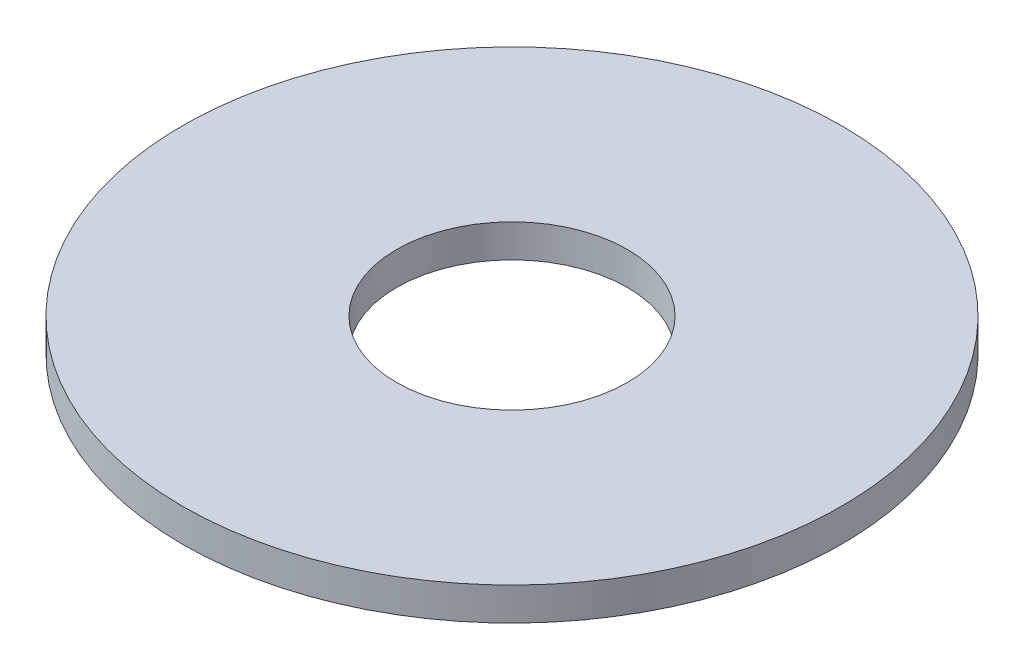
ISO-10303-21;
HEADER;
FILE_DESCRIPTION(('STEP AP214'),'2;1');
FILE_NAME('part.step','',(''),(''),'','','');
FILE_SCHEMA(('AUTOMOTIVE_DESIGN { 1 0 10303 214 1 1 1 1 }'));
ENDSEC;
DATA;
#1=APPLICATION_CONTEXT('core data for automotive mechanical design processes');
#2=APPLICATION_PROTOCOL_DEFINITION('international standard','automotive_design',2000,#1);
#3=PRODUCT_CONTEXT('',#1,'mechanical');
#4=PRODUCT('Part','Part','',(#3));
#5=PRODUCT_RELATED_PRODUCT_CATEGORY('part','',(#4));
#6=PRODUCT_DEFINITION_FORMATION('','',#4);
#7=PRODUCT_DEFINITION_CONTEXT('part definition',#1,'design');
#8=PRODUCT_DEFINITION('design','',#6,#7);
#9=PRODUCT_DEFINITION_SHAPE('','',#8);
#10=(LENGTH_UNIT() NAMED_UNIT(*) SI_UNIT(.MILLI.,.METRE.));
#11=(NAMED_UNIT(*) PLANE_ANGLE_UNIT() SI_UNIT($,.RADIAN.));
#12=(NAMED_UNIT(*) SI_UNIT($,.STERADIAN.) SOLID_ANGLE_UNIT());
#13=UNCERTAINTY_MEASURE_WITH_UNIT(LENGTH_MEASURE(1.E-05),#10,'distance_accuracy_value','');
#14=(GEOMETRIC_REPRESENTATION_CONTEXT(3) GLOBAL_UNCERTAINTY_ASSIGNED_CONTEXT((#13)) GLOBAL_UNIT_ASSIGNED_CONTEXT((#10,
#11,#12)) REPRESENTATION_CONTEXT('',''));
#15=CARTESIAN_POINT('',(0.,0.,0.));
#16=DIRECTION('',(0.,0.,1.));
#17=DIRECTION('',(1.,0.,0.));
#18=AXIS2_PLACEMENT_3D('',#15,#16,#17);
#19=CARTESIAN_POINT('',(0.,5.,0.));
#20=DIRECTION('',(0.,1.,0.));
#21=DIRECTION('',(0.,0.,1.));
#22=AXIS2_PLACEMENT_3D('',#19,#20,#21);
#23=PLANE('',#22);
#24=CARTESIAN_POINT('',(0.,5.,0.));
#25=DIRECTION('',(0.,1.,0.));
#26=DIRECTION('',(0.,0.,1.));
#27=AXIS2_PLACEMENT_3D('',#24,#25,#26);
#28=CIRCLE('',#27,50.);
#29=CARTESIAN_POINT('',(0.,5.,50.));
#30=VERTEX_POINT('',#29);
#31=EDGE_CURVE('E10',#30,#30,#28,.T.);
#32=ORIENTED_EDGE('',*,*,#31,.T.);
#33=EDGE_LOOP('',(#32));
#34=FACE_BOUND('',#33,.T.);
#35=CARTESIAN_POINT('',(0.,5.,0.));
#36=DIRECTION('',(0.,1.,0.));
#37=DIRECTION('',(0.,0.,1.));
#38=AXIS2_PLACEMENT_3D('',#35,#36,#37);
#39=CIRCLE('',#38,17.5);
#40=CARTESIAN_POINT('',(0.,5.,17.5));
#41=VERTEX_POINT('',#40);
#42=EDGE_CURVE('E47',#41,#41,#39,.T.);
#43=ORIENTED_EDGE('',*,*,#42,.F.);
#44=EDGE_LOOP('',(#43));
#45=FACE_BOUND('',#44,.T.);
#46=ADVANCED_FACE('F36',(#34,#45),#23,.T.);
#47=CARTESIAN_POINT('',(0.,0.,0.));
#48=DIRECTION('',(0.,1.,0.));
#49=DIRECTION('',(0.,0.,1.));
#50=AXIS2_PLACEMENT_3D('',#47,#48,#49);
#51=PLANE('',#50);
#52=CARTESIAN_POINT('',(0.,0.,0.));
#53=DIRECTION('',(0.,1.,0.));
#54=DIRECTION('',(0.,0.,1.));
#55=AXIS2_PLACEMENT_3D('',#52,#53,#54);
#56=CIRCLE('',#55,50.);
#57=CARTESIAN_POINT('',(0.,0.,50.));
#58=VERTEX_POINT('',#57);
#59=EDGE_CURVE('E40',#58,#58,#56,.T.);
#60=ORIENTED_EDGE('',*,*,#59,.F.);
#61=EDGE_LOOP('',(#60));
#62=FACE_BOUND('',#61,.T.);
#63=CARTESIAN_POINT('',(0.,0.,0.));
#64=DIRECTION('',(0.,1.,0.));
#65=DIRECTION('',(0.,0.,1.));
#66=AXIS2_PLACEMENT_3D('',#63,#64,#65);
#67=CIRCLE('',#66,17.5);
#68=CARTESIAN_POINT('',(0.,0.,17.5));
#69=VERTEX_POINT('',#68);
#70=EDGE_CURVE('E49',#69,#69,#67,.T.);
#71=ORIENTED_EDGE('',*,*,#70,.T.);
#72=EDGE_LOOP('',(#71));
#73=FACE_BOUND('',#72,.T.);
#74=ADVANCED_FACE('F59',(#62,#73),#51,.F.);
#75=CARTESIAN_POINT('',(0.,5.,0.));
#76=DIRECTION('',(0.,-1.,0.));
#77=DIRECTION('',(0.,0.,-1.));
#78=AXIS2_PLACEMENT_3D('',#75,#76,#77);
#79=CYLINDRICAL_SURFACE('',#78,50.);
#80=ORIENTED_EDGE('',*,*,#31,.F.);
#81=EDGE_LOOP('',(#80));
#82=FACE_BOUND('',#81,.T.);
#83=ORIENTED_EDGE('',*,*,#59,.T.);
#84=EDGE_LOOP('',(#83));
#85=FACE_BOUND('',#84,.T.);
#86=ADVANCED_FACE('F38',(#82,#85),#79,.T.);
#87=CARTESIAN_POINT('',(0.,5.,0.));
#88=DIRECTION('',(0.,-1.,0.));
#89=DIRECTION('',(0.,0.,-1.));
#90=AXIS2_PLACEMENT_3D('',#87,#88,#89);
#91=CYLINDRICAL_SURFACE('',#90,17.5);
#92=ORIENTED_EDGE('',*,*,#42,.T.);
#93=EDGE_LOOP('',(#92));
#94=FACE_BOUND('',#93,.T.);
#95=ORIENTED_EDGE('',*,*,#70,.F.);
#96=EDGE_LOOP('',(#95));
#97=FACE_BOUND('',#96,.T.);
#98=ADVANCED_FACE('F55',(#94,#97),#91,.F.);
#99=CLOSED_SHELL('',(#46,#74,#86,#98));
#100=MANIFOLD_SOLID_BREP('B2',#99);
#101=ADVANCED_BREP_SHAPE_REPRESENTATION('',(#18,#100),#14);
#102=SHAPE_DEFINITION_REPRESENTATION(#9,#101);
ENDSEC;
END-ISO-10303-21;
